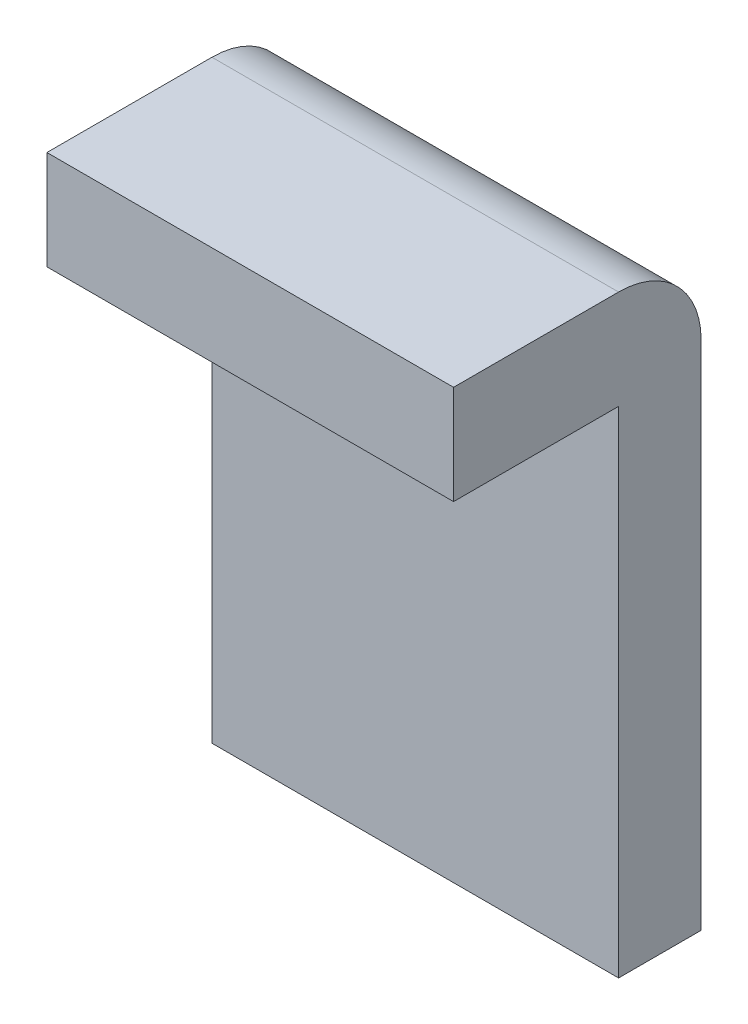
ISO-10303-21;
HEADER;
FILE_DESCRIPTION(('STEP AP214'),'2;1');
FILE_NAME('part.step','',(''),(''),'','','');
FILE_SCHEMA(('AUTOMOTIVE_DESIGN { 1 0 10303 214 1 1 1 1 }'));
ENDSEC;
DATA;
#1=APPLICATION_CONTEXT('core data for automotive mechanical design processes');
#2=APPLICATION_PROTOCOL_DEFINITION('international standard','automotive_design',2000,#1);
#3=PRODUCT_CONTEXT('',#1,'mechanical');
#4=PRODUCT('Part','Part','',(#3));
#5=PRODUCT_RELATED_PRODUCT_CATEGORY('part','',(#4));
#6=PRODUCT_DEFINITION_FORMATION('','',#4);
#7=PRODUCT_DEFINITION_CONTEXT('part definition',#1,'design');
#8=PRODUCT_DEFINITION('design','',#6,#7);
#9=PRODUCT_DEFINITION_SHAPE('','',#8);
#10=(LENGTH_UNIT() NAMED_UNIT(*) SI_UNIT(.MILLI.,.METRE.));
#11=(NAMED_UNIT(*) PLANE_ANGLE_UNIT() SI_UNIT($,.RADIAN.));
#12=(NAMED_UNIT(*) SI_UNIT($,.STERADIAN.) SOLID_ANGLE_UNIT());
#13=UNCERTAINTY_MEASURE_WITH_UNIT(LENGTH_MEASURE(1.E-05),#10,'distance_accuracy_value','');
#14=(GEOMETRIC_REPRESENTATION_CONTEXT(3) GLOBAL_UNCERTAINTY_ASSIGNED_CONTEXT((#13)) GLOBAL_UNIT_ASSIGNED_CONTEXT((#10,
#11,#12)) REPRESENTATION_CONTEXT('',''));
#15=CARTESIAN_POINT('',(0.,0.,0.));
#16=DIRECTION('',(0.,0.,1.));
#17=DIRECTION('',(1.,0.,0.));
#18=AXIS2_PLACEMENT_3D('',#15,#16,#17);
#19=CARTESIAN_POINT('',(-8.34906661620967,8.30000000000001,4.25467377707551));
#20=DIRECTION('',(0.,1.,0.));
#21=DIRECTION('',(0.,0.,1.));
#22=AXIS2_PLACEMENT_3D('',#19,#20,#21);
#23=PLANE('',#22);
#24=DIRECTION('',(1.,0.,0.));
#25=VECTOR('',#24,1.);
#26=CARTESIAN_POINT('',(24.2181314712827,8.30000000000001,4.25467377707551));
#27=LINE('',#26,#25);
#28=CARTESIAN_POINT('',(24.2181314712827,8.30000000000001,4.25467377707551));
#29=VERTEX_POINT('',#28);
#30=CARTESIAN_POINT('',(25.4502822277234,8.30000000000001,4.25467377707551));
#31=VERTEX_POINT('',#30);
#32=EDGE_CURVE('E133',#29,#31,#27,.T.);
#33=ORIENTED_EDGE('',*,*,#32,.F.);
#34=DIRECTION('',(0.,0.,1.));
#35=VECTOR('',#34,1.);
#36=CARTESIAN_POINT('',(24.2181314712827,8.30000000000001,4.25467377707552));
#37=LINE('',#36,#35);
#38=CARTESIAN_POINT('',(24.2181314712827,8.30000000000001,3.75467377707551));
#39=VERTEX_POINT('',#38);
#40=EDGE_CURVE('E113',#39,#29,#37,.T.);
#41=ORIENTED_EDGE('',*,*,#40,.F.);
#42=DIRECTION('',(1.,0.,0.));
#43=VECTOR('',#42,1.);
#44=CARTESIAN_POINT('',(-8.34906661620967,8.30000000000001,3.75467377707551));
#45=LINE('',#44,#43);
#46=CARTESIAN_POINT('',(25.4502822277234,8.30000000000001,3.75467377707551));
#47=VERTEX_POINT('',#46);
#48=EDGE_CURVE('E130',#39,#47,#45,.T.);
#49=ORIENTED_EDGE('',*,*,#48,.T.);
#50=DIRECTION('',(0.,0.,-1.));
#51=VECTOR('',#50,1.);
#52=CARTESIAN_POINT('',(25.4502822277234,8.30000000000001,4.25467377707552));
#53=LINE('',#52,#51);
#54=EDGE_CURVE('E129',#31,#47,#53,.T.);
#55=ORIENTED_EDGE('',*,*,#54,.F.);
#56=EDGE_LOOP('',(#33,#41,#49,#55));
#57=FACE_BOUND('',#56,.T.);
#58=ADVANCED_FACE('F17',(#57),#23,.F.);
#59=CARTESIAN_POINT('',(24.2181314712827,5.35753839337144,4.25467377707552));
#60=DIRECTION('',(0.,0.,1.));
#61=DIRECTION('',(0.,-1.,0.));
#62=AXIS2_PLACEMENT_3D('',#59,#60,#61);
#63=PLANE('',#62);
#64=DIRECTION('',(1.,0.,0.));
#65=VECTOR('',#64,1.);
#66=CARTESIAN_POINT('',(-8.34906661620967,8.6,4.25467377707551));
#67=LINE('',#66,#65);
#68=CARTESIAN_POINT('',(25.4502822277234,8.6,4.25467377707551));
#69=VERTEX_POINT('',#68);
#70=CARTESIAN_POINT('',(24.2181314712827,8.6,4.25467377707551));
#71=VERTEX_POINT('',#70);
#72=EDGE_CURVE('E131',#69,#71,#67,.F.);
#73=ORIENTED_EDGE('',*,*,#72,.T.);
#74=DIRECTION('',(0.,1.,0.));
#75=VECTOR('',#74,1.);
#76=CARTESIAN_POINT('',(24.2181314712827,5.35753839337144,4.25467377707551));
#77=LINE('',#76,#75);
#78=EDGE_CURVE('E136',#29,#71,#77,.T.);
#79=ORIENTED_EDGE('',*,*,#78,.F.);
#80=ORIENTED_EDGE('',*,*,#32,.T.);
#81=DIRECTION('',(0.,1.,0.));
#82=VECTOR('',#81,1.);
#83=CARTESIAN_POINT('',(25.4502822277234,5.35753839337144,4.25467377707551));
#84=LINE('',#83,#82);
#85=EDGE_CURVE('E120',#69,#31,#84,.F.);
#86=ORIENTED_EDGE('',*,*,#85,.F.);
#87=EDGE_LOOP('',(#73,#79,#80,#86));
#88=FACE_BOUND('',#87,.T.);
#89=ADVANCED_FACE('F172',(#88),#63,.T.);
#90=CARTESIAN_POINT('',(-8.34906661620967,8.6,4.25467377707551));
#91=DIRECTION('',(0.,-1.,0.));
#92=DIRECTION('',(0.,0.,-1.));
#93=AXIS2_PLACEMENT_3D('',#90,#91,#92);
#94=PLANE('',#93);
#95=DIRECTION('',(1.,0.,0.));
#96=VECTOR('',#95,1.);
#97=CARTESIAN_POINT('',(-8.34906661620967,8.6,3.75467377707551));
#98=LINE('',#97,#96);
#99=CARTESIAN_POINT('',(24.2181314712827,8.6,3.7546737770755));
#100=VERTEX_POINT('',#99);
#101=CARTESIAN_POINT('',(25.4502822277234,8.6,3.7546737770755));
#102=VERTEX_POINT('',#101);
#103=EDGE_CURVE('E79',#100,#102,#98,.T.);
#104=ORIENTED_EDGE('',*,*,#103,.F.);
#105=DIRECTION('',(0.,0.,1.));
#106=VECTOR('',#105,1.);
#107=CARTESIAN_POINT('',(24.2181314712827,8.6,4.25467377707552));
#108=LINE('',#107,#106);
#109=EDGE_CURVE('E139',#71,#100,#108,.F.);
#110=ORIENTED_EDGE('',*,*,#109,.F.);
#111=ORIENTED_EDGE('',*,*,#72,.F.);
#112=DIRECTION('',(0.,0.,-1.));
#113=VECTOR('',#112,1.);
#114=CARTESIAN_POINT('',(25.4502822277234,8.6,4.25467377707552));
#115=LINE('',#114,#113);
#116=EDGE_CURVE('E83',#102,#69,#115,.F.);
#117=ORIENTED_EDGE('',*,*,#116,.F.);
#118=EDGE_LOOP('',(#104,#110,#111,#117));
#119=FACE_BOUND('',#118,.T.);
#120=ADVANCED_FACE('F169',(#119),#94,.F.);
#121=CARTESIAN_POINT('',(-8.34906661620967,8.30000000000001,3.75467377707551));
#122=DIRECTION('',(0.,0.,-1.));
#123=DIRECTION('',(0.,1.,0.));
#124=AXIS2_PLACEMENT_3D('',#121,#122,#123);
#125=PLANE('',#124);
#126=ORIENTED_EDGE('',*,*,#48,.F.);
#127=DIRECTION('',(0.,1.,0.));
#128=VECTOR('',#127,1.);
#129=CARTESIAN_POINT('',(24.2181314712827,5.35753839337144,3.75467377707551));
#130=LINE('',#129,#128);
#131=CARTESIAN_POINT('',(24.2181314712827,6.8,3.75467377707551));
#132=VERTEX_POINT('',#131);
#133=EDGE_CURVE('E95',#132,#39,#130,.T.);
#134=ORIENTED_EDGE('',*,*,#133,.F.);
#135=DIRECTION('',(1.,0.,0.));
#136=VECTOR('',#135,1.);
#137=CARTESIAN_POINT('',(-15.8147962412963,6.8,3.75467377707551));
#138=LINE('',#137,#136);
#139=CARTESIAN_POINT('',(25.4502822277234,6.8,3.75467377707551));
#140=VERTEX_POINT('',#139);
#141=EDGE_CURVE('E114',#140,#132,#138,.F.);
#142=ORIENTED_EDGE('',*,*,#141,.F.);
#143=DIRECTION('',(0.,1.,0.));
#144=VECTOR('',#143,1.);
#145=CARTESIAN_POINT('',(25.4502822277234,5.35753839337144,3.75467377707551));
#146=LINE('',#145,#144);
#147=EDGE_CURVE('E84',#47,#140,#146,.F.);
#148=ORIENTED_EDGE('',*,*,#147,.F.);
#149=EDGE_LOOP('',(#126,#134,#142,#148));
#150=FACE_BOUND('',#149,.T.);
#151=ADVANCED_FACE('F178',(#150),#125,.F.);
#152=CARTESIAN_POINT('',(-8.34906661620967,8.35,3.7546737770755));
#153=DIRECTION('',(1.,0.,0.));
#154=DIRECTION('',(0.,0.,-1.));
#155=AXIS2_PLACEMENT_3D('',#152,#153,#154);
#156=CYLINDRICAL_SURFACE('',#155,0.249999999999996);
#157=CARTESIAN_POINT('',(24.2181314712827,8.35,3.7546737770755));
#158=DIRECTION('',(1.,0.,0.));
#159=DIRECTION('',(0.,0.,-1.));
#160=AXIS2_PLACEMENT_3D('',#157,#158,#159);
#161=CIRCLE('',#160,0.249999999999996);
#162=CARTESIAN_POINT('',(24.2181314712827,8.35,3.50467377707551));
#163=VERTEX_POINT('',#162);
#164=EDGE_CURVE('E106',#100,#163,#161,.F.);
#165=ORIENTED_EDGE('',*,*,#164,.F.);
#166=ORIENTED_EDGE('',*,*,#103,.T.);
#167=CARTESIAN_POINT('',(25.4502822277234,8.35,3.7546737770755));
#168=DIRECTION('',(1.,0.,0.));
#169=DIRECTION('',(0.,0.,-1.));
#170=AXIS2_PLACEMENT_3D('',#167,#168,#169);
#171=CIRCLE('',#170,0.249999999999996);
#172=CARTESIAN_POINT('',(25.4502822277234,8.35,3.50467377707551));
#173=VERTEX_POINT('',#172);
#174=EDGE_CURVE('E20',#173,#102,#171,.T.);
#175=ORIENTED_EDGE('',*,*,#174,.F.);
#176=DIRECTION('',(1.,0.,0.));
#177=VECTOR('',#176,1.);
#178=CARTESIAN_POINT('',(24.2181314712827,8.35,3.50467377707551));
#179=LINE('',#178,#177);
#180=EDGE_CURVE('E77',#163,#173,#179,.T.);
#181=ORIENTED_EDGE('',*,*,#180,.F.);
#182=EDGE_LOOP('',(#165,#166,#175,#181));
#183=FACE_BOUND('',#182,.T.);
#184=ADVANCED_FACE('F75',(#183),#156,.T.);
#185=CARTESIAN_POINT('',(25.4502822277234,5.35753839337144,4.25467377707552));
#186=DIRECTION('',(1.,0.,0.));
#187=DIRECTION('',(0.,0.,-1.));
#188=AXIS2_PLACEMENT_3D('',#185,#186,#187);
#189=PLANE('',#188);
#190=ORIENTED_EDGE('',*,*,#116,.T.);
#191=ORIENTED_EDGE('',*,*,#85,.T.);
#192=ORIENTED_EDGE('',*,*,#54,.T.);
#193=ORIENTED_EDGE('',*,*,#147,.T.);
#194=DIRECTION('',(0.,0.,-1.));
#195=VECTOR('',#194,1.);
#196=CARTESIAN_POINT('',(25.4502822277234,6.80000000000003,12.5046737770755));
#197=LINE('',#196,#195);
#198=CARTESIAN_POINT('',(25.4502822277234,6.8,3.50467377707552));
#199=VERTEX_POINT('',#198);
#200=EDGE_CURVE('E90',#199,#140,#197,.F.);
#201=ORIENTED_EDGE('',*,*,#200,.F.);
#202=DIRECTION('',(0.,1.,0.));
#203=VECTOR('',#202,1.);
#204=CARTESIAN_POINT('',(25.4502822277234,5.35753839337143,3.50467377707552));
#205=LINE('',#204,#203);
#206=EDGE_CURVE('E86',#173,#199,#205,.F.);
#207=ORIENTED_EDGE('',*,*,#206,.F.);
#208=ORIENTED_EDGE('',*,*,#174,.T.);
#209=EDGE_LOOP('',(#190,#191,#192,#193,#201,#207,#208));
#210=FACE_BOUND('',#209,.T.);
#211=ADVANCED_FACE('F87',(#210),#189,.T.);
#212=CARTESIAN_POINT('',(-15.8147962412963,6.80000000000003,12.5046737770755));
#213=DIRECTION('',(0.,-1.,0.));
#214=DIRECTION('',(0.,0.,-1.));
#215=AXIS2_PLACEMENT_3D('',#212,#213,#214);
#216=PLANE('',#215);
#217=DIRECTION('',(1.,0.,0.));
#218=VECTOR('',#217,1.);
#219=CARTESIAN_POINT('',(24.2181314712827,6.8,3.50467377707552));
#220=LINE('',#219,#218);
#221=CARTESIAN_POINT('',(24.2181314712827,6.8,3.50467377707552));
#222=VERTEX_POINT('',#221);
#223=EDGE_CURVE('E26',#199,#222,#220,.F.);
#224=ORIENTED_EDGE('',*,*,#223,.F.);
#225=ORIENTED_EDGE('',*,*,#200,.T.);
#226=ORIENTED_EDGE('',*,*,#141,.T.);
#227=DIRECTION('',(0.,0.,1.));
#228=VECTOR('',#227,1.);
#229=CARTESIAN_POINT('',(24.2181314712827,6.8,4.25467377707552));
#230=LINE('',#229,#228);
#231=EDGE_CURVE('E35',#222,#132,#230,.T.);
#232=ORIENTED_EDGE('',*,*,#231,.F.);
#233=EDGE_LOOP('',(#224,#225,#226,#232));
#234=FACE_BOUND('',#233,.T.);
#235=ADVANCED_FACE('F179',(#234),#216,.T.);
#236=CARTESIAN_POINT('',(24.2181314712827,5.35753839337144,4.25467377707552));
#237=DIRECTION('',(-1.,0.,0.));
#238=DIRECTION('',(0.,0.,1.));
#239=AXIS2_PLACEMENT_3D('',#236,#237,#238);
#240=PLANE('',#239);
#241=ORIENTED_EDGE('',*,*,#231,.T.);
#242=ORIENTED_EDGE('',*,*,#133,.T.);
#243=ORIENTED_EDGE('',*,*,#40,.T.);
#244=ORIENTED_EDGE('',*,*,#78,.T.);
#245=ORIENTED_EDGE('',*,*,#109,.T.);
#246=ORIENTED_EDGE('',*,*,#164,.T.);
#247=DIRECTION('',(0.,1.,0.));
#248=VECTOR('',#247,1.);
#249=CARTESIAN_POINT('',(24.2181314712827,5.35753839337143,3.50467377707552));
#250=LINE('',#249,#248);
#251=EDGE_CURVE('E11',#222,#163,#250,.T.);
#252=ORIENTED_EDGE('',*,*,#251,.F.);
#253=EDGE_LOOP('',(#241,#242,#243,#244,#245,#246,#252));
#254=FACE_BOUND('',#253,.T.);
#255=ADVANCED_FACE('F166',(#254),#240,.T.);
#256=CARTESIAN_POINT('',(24.2181314712827,5.35753839337143,3.50467377707552));
#257=DIRECTION('',(0.,0.,-1.));
#258=DIRECTION('',(0.,1.,0.));
#259=AXIS2_PLACEMENT_3D('',#256,#257,#258);
#260=PLANE('',#259);
#261=ORIENTED_EDGE('',*,*,#223,.T.);
#262=ORIENTED_EDGE('',*,*,#251,.T.);
#263=ORIENTED_EDGE('',*,*,#180,.T.);
#264=ORIENTED_EDGE('',*,*,#206,.T.);
#265=EDGE_LOOP('',(#261,#262,#263,#264));
#266=FACE_BOUND('',#265,.T.);
#267=ADVANCED_FACE('F94',(#266),#260,.T.);
#268=CLOSED_SHELL('',(#58,#89,#120,#151,#184,#211,#235,#255,#267));
#269=MANIFOLD_SOLID_BREP('B1',#268);
#270=ADVANCED_BREP_SHAPE_REPRESENTATION('',(#18,#269),#14);
#271=SHAPE_DEFINITION_REPRESENTATION(#9,#270);
ENDSEC;
END-ISO-10303-21;
